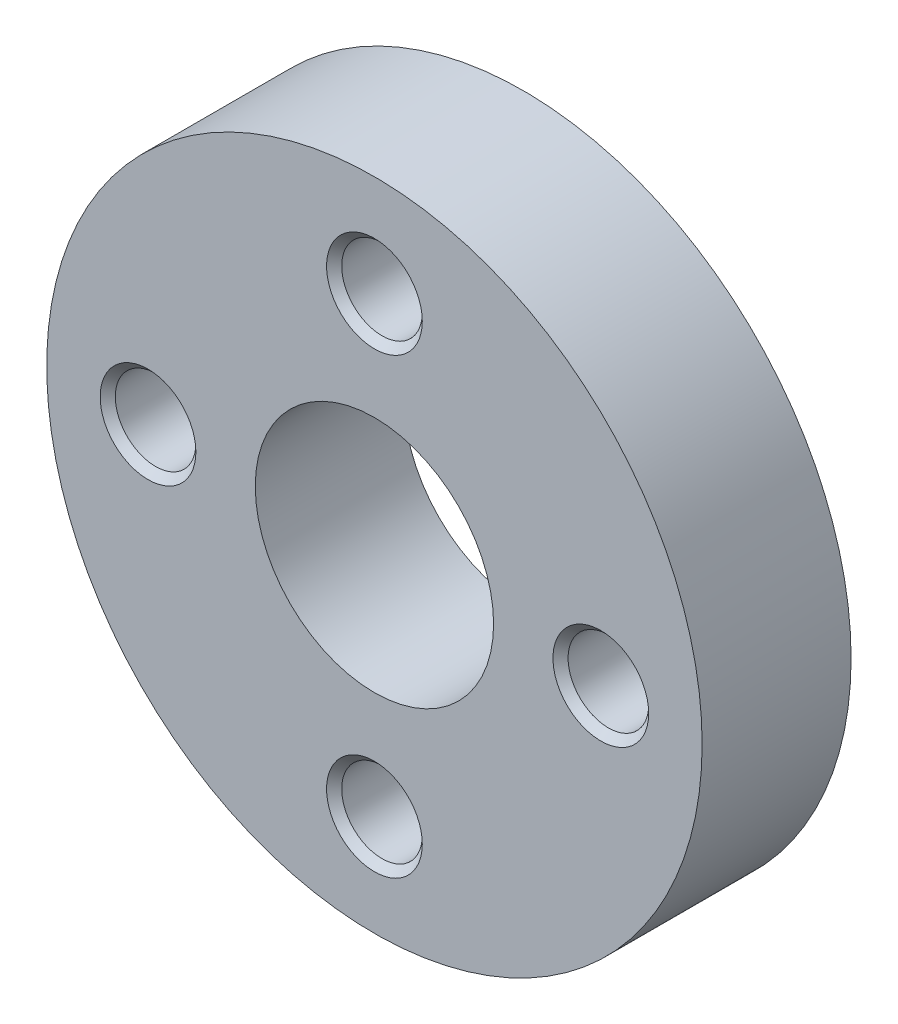
ISO-10303-21;
HEADER;
FILE_DESCRIPTION(('STEP AP214'),'2;1');
FILE_NAME('part.step','',(''),(''),'','','');
FILE_SCHEMA(('AUTOMOTIVE_DESIGN { 1 0 10303 214 1 1 1 1 }'));
ENDSEC;
DATA;
#1=APPLICATION_CONTEXT('core data for automotive mechanical design processes');
#2=APPLICATION_PROTOCOL_DEFINITION('international standard','automotive_design',2000,#1);
#3=PRODUCT_CONTEXT('',#1,'mechanical');
#4=PRODUCT('Part','Part','',(#3));
#5=PRODUCT_RELATED_PRODUCT_CATEGORY('part','',(#4));
#6=PRODUCT_DEFINITION_FORMATION('','',#4);
#7=PRODUCT_DEFINITION_CONTEXT('part definition',#1,'design');
#8=PRODUCT_DEFINITION('design','',#6,#7);
#9=PRODUCT_DEFINITION_SHAPE('','',#8);
#10=(LENGTH_UNIT() NAMED_UNIT(*) SI_UNIT(.MILLI.,.METRE.));
#11=(NAMED_UNIT(*) PLANE_ANGLE_UNIT() SI_UNIT($,.RADIAN.));
#12=(NAMED_UNIT(*) SI_UNIT($,.STERADIAN.) SOLID_ANGLE_UNIT());
#13=UNCERTAINTY_MEASURE_WITH_UNIT(LENGTH_MEASURE(1.E-05),#10,'distance_accuracy_value','');
#14=(GEOMETRIC_REPRESENTATION_CONTEXT(3) GLOBAL_UNCERTAINTY_ASSIGNED_CONTEXT((#13)) GLOBAL_UNIT_ASSIGNED_CONTEXT((#10,
#11,#12)) REPRESENTATION_CONTEXT('',''));
#15=CARTESIAN_POINT('',(0.,0.,0.));
#16=DIRECTION('',(0.,0.,1.));
#17=DIRECTION('',(1.,0.,0.));
#18=AXIS2_PLACEMENT_3D('',#15,#16,#17);
#19=CARTESIAN_POINT('',(0.,0.,-2.5));
#20=DIRECTION('',(0.,0.,1.));
#21=DIRECTION('',(1.,0.,0.));
#22=AXIS2_PLACEMENT_3D('',#19,#20,#21);
#23=CYLINDRICAL_SURFACE('',#22,11.);
#24=CARTESIAN_POINT('',(0.,0.,-2.5));
#25=DIRECTION('',(0.,0.,1.));
#26=DIRECTION('',(1.,0.,0.));
#27=AXIS2_PLACEMENT_3D('',#24,#25,#26);
#28=CIRCLE('',#27,11.);
#29=CARTESIAN_POINT('',(11.,0.,-2.5));
#30=VERTEX_POINT('',#29);
#31=EDGE_CURVE('E85',#30,#30,#28,.T.);
#32=ORIENTED_EDGE('',*,*,#31,.T.);
#33=EDGE_LOOP('',(#32));
#34=FACE_BOUND('',#33,.T.);
#35=CARTESIAN_POINT('',(0.,0.,2.5));
#36=DIRECTION('',(0.,0.,1.));
#37=DIRECTION('',(1.,0.,0.));
#38=AXIS2_PLACEMENT_3D('',#35,#36,#37);
#39=CIRCLE('',#38,11.);
#40=CARTESIAN_POINT('',(11.,0.,2.5));
#41=VERTEX_POINT('',#40);
#42=EDGE_CURVE('E86',#41,#41,#39,.T.);
#43=ORIENTED_EDGE('',*,*,#42,.F.);
#44=EDGE_LOOP('',(#43));
#45=FACE_BOUND('',#44,.T.);
#46=ADVANCED_FACE('F29',(#34,#45),#23,.T.);
#47=CARTESIAN_POINT('',(0.,0.,-2.5));
#48=DIRECTION('',(0.,0.,1.));
#49=DIRECTION('',(1.,0.,0.));
#50=AXIS2_PLACEMENT_3D('',#47,#48,#49);
#51=PLANE('',#50);
#52=CARTESIAN_POINT('',(0.,0.,-2.5));
#53=DIRECTION('',(0.,0.,1.));
#54=DIRECTION('',(1.,0.,0.));
#55=AXIS2_PLACEMENT_3D('',#52,#53,#54);
#56=CIRCLE('',#55,4.);
#57=CARTESIAN_POINT('',(4.,0.,-2.5));
#58=VERTEX_POINT('',#57);
#59=EDGE_CURVE('E89',#58,#58,#56,.T.);
#60=ORIENTED_EDGE('',*,*,#59,.T.);
#61=EDGE_LOOP('',(#60));
#62=FACE_BOUND('',#61,.T.);
#63=CARTESIAN_POINT('',(0.,-7.59934207678533,-2.5));
#64=DIRECTION('',(0.,0.,1.));
#65=DIRECTION('',(1.,0.,0.));
#66=AXIS2_PLACEMENT_3D('',#63,#64,#65);
#67=CIRCLE('',#66,1.60654999999999);
#68=CARTESIAN_POINT('',(1.60654999999999,-7.59934207678533,-2.5));
#69=VERTEX_POINT('',#68);
#70=EDGE_CURVE('E73',#69,#69,#67,.T.);
#71=ORIENTED_EDGE('',*,*,#70,.T.);
#72=EDGE_LOOP('',(#71));
#73=FACE_BOUND('',#72,.T.);
#74=CARTESIAN_POINT('',(-7.59934207678533,0.,-2.5));
#75=DIRECTION('',(0.,0.,1.));
#76=DIRECTION('',(1.,0.,0.));
#77=AXIS2_PLACEMENT_3D('',#74,#75,#76);
#78=CIRCLE('',#77,1.60655);
#79=CARTESIAN_POINT('',(-5.99279207678533,0.,-2.5));
#80=VERTEX_POINT('',#79);
#81=EDGE_CURVE('E76',#80,#80,#78,.T.);
#82=ORIENTED_EDGE('',*,*,#81,.T.);
#83=EDGE_LOOP('',(#82));
#84=FACE_BOUND('',#83,.T.);
#85=CARTESIAN_POINT('',(0.,7.59934207678533,-2.5));
#86=DIRECTION('',(0.,0.,1.));
#87=DIRECTION('',(1.,0.,0.));
#88=AXIS2_PLACEMENT_3D('',#85,#86,#87);
#89=CIRCLE('',#88,1.60654999999999);
#90=CARTESIAN_POINT('',(1.60654999999999,7.59934207678533,-2.5));
#91=VERTEX_POINT('',#90);
#92=EDGE_CURVE('E79',#91,#91,#89,.T.);
#93=ORIENTED_EDGE('',*,*,#92,.T.);
#94=EDGE_LOOP('',(#93));
#95=FACE_BOUND('',#94,.T.);
#96=CARTESIAN_POINT('',(7.59934207678533,0.,-2.5));
#97=DIRECTION('',(0.,0.,1.));
#98=DIRECTION('',(1.,0.,0.));
#99=AXIS2_PLACEMENT_3D('',#96,#97,#98);
#100=CIRCLE('',#99,1.60654999999999);
#101=CARTESIAN_POINT('',(9.20589207678533,0.,-2.5));
#102=VERTEX_POINT('',#101);
#103=EDGE_CURVE('E82',#102,#102,#100,.T.);
#104=ORIENTED_EDGE('',*,*,#103,.T.);
#105=EDGE_LOOP('',(#104));
#106=FACE_BOUND('',#105,.T.);
#107=ORIENTED_EDGE('',*,*,#31,.F.);
#108=EDGE_LOOP('',(#107));
#109=FACE_BOUND('',#108,.T.);
#110=ADVANCED_FACE('F98',(#62,#73,#84,#95,#106,#109),#51,.F.);
#111=CARTESIAN_POINT('',(0.,0.,2.5));
#112=DIRECTION('',(0.,0.,1.));
#113=DIRECTION('',(1.,0.,0.));
#114=AXIS2_PLACEMENT_3D('',#111,#112,#113);
#115=PLANE('',#114);
#116=CARTESIAN_POINT('',(0.,0.,2.5));
#117=DIRECTION('',(0.,0.,1.));
#118=DIRECTION('',(1.,0.,0.));
#119=AXIS2_PLACEMENT_3D('',#116,#117,#118);
#120=CIRCLE('',#119,4.);
#121=CARTESIAN_POINT('',(4.,0.,2.5));
#122=VERTEX_POINT('',#121);
#123=EDGE_CURVE('E92',#122,#122,#120,.T.);
#124=ORIENTED_EDGE('',*,*,#123,.F.);
#125=EDGE_LOOP('',(#124));
#126=FACE_BOUND('',#125,.T.);
#127=CARTESIAN_POINT('',(7.59934207678533,0.,2.5));
#128=DIRECTION('',(0.,0.,1.));
#129=DIRECTION('',(1.,0.,0.));
#130=AXIS2_PLACEMENT_3D('',#127,#128,#129);
#131=CIRCLE('',#130,1.60654999999999);
#132=CARTESIAN_POINT('',(9.20589207678532,0.,2.5));
#133=VERTEX_POINT('',#132);
#134=EDGE_CURVE('E10',#133,#133,#131,.F.);
#135=ORIENTED_EDGE('',*,*,#134,.T.);
#136=EDGE_LOOP('',(#135));
#137=FACE_BOUND('',#136,.T.);
#138=CARTESIAN_POINT('',(0.,-7.59934207678533,2.5));
#139=DIRECTION('',(0.,0.,1.));
#140=DIRECTION('',(1.,0.,0.));
#141=AXIS2_PLACEMENT_3D('',#138,#139,#140);
#142=CIRCLE('',#141,1.60654999999999);
#143=CARTESIAN_POINT('',(1.60654999999999,-7.59934207678533,2.5));
#144=VERTEX_POINT('',#143);
#145=EDGE_CURVE('E36',#144,#144,#142,.F.);
#146=ORIENTED_EDGE('',*,*,#145,.T.);
#147=EDGE_LOOP('',(#146));
#148=FACE_BOUND('',#147,.T.);
#149=CARTESIAN_POINT('',(-7.59934207678533,0.,2.5));
#150=DIRECTION('',(0.,0.,1.));
#151=DIRECTION('',(1.,0.,0.));
#152=AXIS2_PLACEMENT_3D('',#149,#150,#151);
#153=CIRCLE('',#152,1.60654999999999);
#154=CARTESIAN_POINT('',(-5.99279207678534,0.,2.5));
#155=VERTEX_POINT('',#154);
#156=EDGE_CURVE('E40',#155,#155,#153,.F.);
#157=ORIENTED_EDGE('',*,*,#156,.T.);
#158=EDGE_LOOP('',(#157));
#159=FACE_BOUND('',#158,.T.);
#160=CARTESIAN_POINT('',(0.,7.59934207678533,2.5));
#161=DIRECTION('',(0.,0.,1.));
#162=DIRECTION('',(1.,0.,0.));
#163=AXIS2_PLACEMENT_3D('',#160,#161,#162);
#164=CIRCLE('',#163,1.60654999999999);
#165=CARTESIAN_POINT('',(1.60654999999999,7.59934207678533,2.5));
#166=VERTEX_POINT('',#165);
#167=EDGE_CURVE('E44',#166,#166,#164,.F.);
#168=ORIENTED_EDGE('',*,*,#167,.T.);
#169=EDGE_LOOP('',(#168));
#170=FACE_BOUND('',#169,.T.);
#171=ORIENTED_EDGE('',*,*,#42,.T.);
#172=EDGE_LOOP('',(#171));
#173=FACE_BOUND('',#172,.T.);
#174=ADVANCED_FACE('F107',(#126,#137,#148,#159,#170,#173),#115,.T.);
#175=CARTESIAN_POINT('',(0.,-7.59934207678533,2.5));
#176=DIRECTION('',(0.,0.,1.));
#177=DIRECTION('',(1.,0.,0.));
#178=AXIS2_PLACEMENT_3D('',#175,#176,#177);
#179=CYLINDRICAL_SURFACE('',#178,1.35254999999999);
#180=CARTESIAN_POINT('',(0.,-7.59934207678533,-2.246));
#181=DIRECTION('',(0.,0.,1.));
#182=DIRECTION('',(1.,0.,0.));
#183=AXIS2_PLACEMENT_3D('',#180,#181,#182);
#184=CIRCLE('',#183,1.35254999999999);
#185=CARTESIAN_POINT('',(1.35254999999999,-7.59934207678533,-2.246));
#186=VERTEX_POINT('',#185);
#187=EDGE_CURVE('E67',#186,#186,#184,.F.);
#188=ORIENTED_EDGE('',*,*,#187,.T.);
#189=EDGE_LOOP('',(#188));
#190=FACE_BOUND('',#189,.T.);
#191=CARTESIAN_POINT('',(0.,-7.59934207678533,2.246));
#192=DIRECTION('',(0.,0.,1.));
#193=DIRECTION('',(1.,0.,0.));
#194=AXIS2_PLACEMENT_3D('',#191,#192,#193);
#195=CIRCLE('',#194,1.35254999999999);
#196=CARTESIAN_POINT('',(1.35254999999999,-7.59934207678533,2.246));
#197=VERTEX_POINT('',#196);
#198=EDGE_CURVE('E70',#197,#197,#195,.T.);
#199=ORIENTED_EDGE('',*,*,#198,.T.);
#200=EDGE_LOOP('',(#199));
#201=FACE_BOUND('',#200,.T.);
#202=ADVANCED_FACE('F109',(#190,#201),#179,.F.);
#203=CARTESIAN_POINT('',(7.59934207678533,0.,2.5));
#204=DIRECTION('',(0.,0.,1.));
#205=DIRECTION('',(1.,0.,0.));
#206=AXIS2_PLACEMENT_3D('',#203,#204,#205);
#207=CYLINDRICAL_SURFACE('',#206,1.35254999999999);
#208=CARTESIAN_POINT('',(7.59934207678533,0.,-2.246));
#209=DIRECTION('',(0.,0.,1.));
#210=DIRECTION('',(1.,0.,0.));
#211=AXIS2_PLACEMENT_3D('',#208,#209,#210);
#212=CIRCLE('',#211,1.35254999999999);
#213=CARTESIAN_POINT('',(8.95189207678532,0.,-2.246));
#214=VERTEX_POINT('',#213);
#215=EDGE_CURVE('E49',#214,#214,#212,.F.);
#216=ORIENTED_EDGE('',*,*,#215,.T.);
#217=EDGE_LOOP('',(#216));
#218=FACE_BOUND('',#217,.T.);
#219=CARTESIAN_POINT('',(7.59934207678533,0.,2.246));
#220=DIRECTION('',(0.,0.,1.));
#221=DIRECTION('',(1.,0.,0.));
#222=AXIS2_PLACEMENT_3D('',#219,#220,#221);
#223=CIRCLE('',#222,1.35254999999999);
#224=CARTESIAN_POINT('',(8.95189207678532,0.,2.246));
#225=VERTEX_POINT('',#224);
#226=EDGE_CURVE('E52',#225,#225,#223,.T.);
#227=ORIENTED_EDGE('',*,*,#226,.T.);
#228=EDGE_LOOP('',(#227));
#229=FACE_BOUND('',#228,.T.);
#230=ADVANCED_FACE('F162',(#218,#229),#207,.F.);
#231=CARTESIAN_POINT('',(-7.59934207678533,0.,2.5));
#232=DIRECTION('',(0.,0.,1.));
#233=DIRECTION('',(1.,0.,0.));
#234=AXIS2_PLACEMENT_3D('',#231,#232,#233);
#235=CYLINDRICAL_SURFACE('',#234,1.35254999999999);
#236=CARTESIAN_POINT('',(-7.59934207678533,0.,-2.24599999999999));
#237=DIRECTION('',(0.,0.,1.));
#238=DIRECTION('',(1.,0.,0.));
#239=AXIS2_PLACEMENT_3D('',#236,#237,#238);
#240=CIRCLE('',#239,1.35254999999999);
#241=CARTESIAN_POINT('',(-6.24679207678534,0.,-2.24599999999999));
#242=VERTEX_POINT('',#241);
#243=EDGE_CURVE('E61',#242,#242,#240,.F.);
#244=ORIENTED_EDGE('',*,*,#243,.T.);
#245=EDGE_LOOP('',(#244));
#246=FACE_BOUND('',#245,.T.);
#247=CARTESIAN_POINT('',(-7.59934207678533,0.,2.246));
#248=DIRECTION('',(0.,0.,1.));
#249=DIRECTION('',(1.,0.,0.));
#250=AXIS2_PLACEMENT_3D('',#247,#248,#249);
#251=CIRCLE('',#250,1.35254999999999);
#252=CARTESIAN_POINT('',(-6.24679207678534,0.,2.246));
#253=VERTEX_POINT('',#252);
#254=EDGE_CURVE('E64',#253,#253,#251,.T.);
#255=ORIENTED_EDGE('',*,*,#254,.T.);
#256=EDGE_LOOP('',(#255));
#257=FACE_BOUND('',#256,.T.);
#258=ADVANCED_FACE('F160',(#246,#257),#235,.F.);
#259=CARTESIAN_POINT('',(0.,7.59934207678533,2.5));
#260=DIRECTION('',(0.,0.,1.));
#261=DIRECTION('',(1.,0.,0.));
#262=AXIS2_PLACEMENT_3D('',#259,#260,#261);
#263=CYLINDRICAL_SURFACE('',#262,1.35254999999999);
#264=CARTESIAN_POINT('',(0.,7.59934207678533,-2.246));
#265=DIRECTION('',(0.,0.,1.));
#266=DIRECTION('',(1.,0.,0.));
#267=AXIS2_PLACEMENT_3D('',#264,#265,#266);
#268=CIRCLE('',#267,1.35254999999999);
#269=CARTESIAN_POINT('',(1.35254999999999,7.59934207678533,-2.246));
#270=VERTEX_POINT('',#269);
#271=EDGE_CURVE('E55',#270,#270,#268,.F.);
#272=ORIENTED_EDGE('',*,*,#271,.T.);
#273=EDGE_LOOP('',(#272));
#274=FACE_BOUND('',#273,.T.);
#275=CARTESIAN_POINT('',(0.,7.59934207678533,2.246));
#276=DIRECTION('',(0.,0.,1.));
#277=DIRECTION('',(1.,0.,0.));
#278=AXIS2_PLACEMENT_3D('',#275,#276,#277);
#279=CIRCLE('',#278,1.35254999999999);
#280=CARTESIAN_POINT('',(1.35254999999999,7.59934207678533,2.246));
#281=VERTEX_POINT('',#280);
#282=EDGE_CURVE('E58',#281,#281,#279,.T.);
#283=ORIENTED_EDGE('',*,*,#282,.T.);
#284=EDGE_LOOP('',(#283));
#285=FACE_BOUND('',#284,.T.);
#286=ADVANCED_FACE('F130',(#274,#285),#263,.F.);
#287=CARTESIAN_POINT('',(0.,-7.59934207678533,-2.5));
#288=DIRECTION('',(0.,0.,-1.));
#289=DIRECTION('',(-1.,0.,0.));
#290=AXIS2_PLACEMENT_3D('',#287,#288,#289);
#291=CONICAL_SURFACE('',#290,1.60654999999999,0.785398163397451);
#292=ORIENTED_EDGE('',*,*,#187,.F.);
#293=EDGE_LOOP('',(#292));
#294=FACE_BOUND('',#293,.T.);
#295=ORIENTED_EDGE('',*,*,#70,.F.);
#296=EDGE_LOOP('',(#295));
#297=FACE_BOUND('',#296,.T.);
#298=ADVANCED_FACE('F126',(#294,#297),#291,.F.);
#299=CARTESIAN_POINT('',(-7.59934207678533,0.,-2.5));
#300=DIRECTION('',(0.,0.,-1.));
#301=DIRECTION('',(-1.,0.,0.));
#302=AXIS2_PLACEMENT_3D('',#299,#300,#301);
#303=CONICAL_SURFACE('',#302,1.60655,0.785398163397441);
#304=ORIENTED_EDGE('',*,*,#243,.F.);
#305=EDGE_LOOP('',(#304));
#306=FACE_BOUND('',#305,.T.);
#307=ORIENTED_EDGE('',*,*,#81,.F.);
#308=EDGE_LOOP('',(#307));
#309=FACE_BOUND('',#308,.T.);
#310=ADVANCED_FACE('F129',(#306,#309),#303,.F.);
#311=CARTESIAN_POINT('',(0.,7.59934207678533,-2.5));
#312=DIRECTION('',(0.,0.,-1.));
#313=DIRECTION('',(-1.,0.,0.));
#314=AXIS2_PLACEMENT_3D('',#311,#312,#313);
#315=CONICAL_SURFACE('',#314,1.60654999999999,0.785398163397451);
#316=ORIENTED_EDGE('',*,*,#271,.F.);
#317=EDGE_LOOP('',(#316));
#318=FACE_BOUND('',#317,.T.);
#319=ORIENTED_EDGE('',*,*,#92,.F.);
#320=EDGE_LOOP('',(#319));
#321=FACE_BOUND('',#320,.T.);
#322=ADVANCED_FACE('F134',(#318,#321),#315,.F.);
#323=CARTESIAN_POINT('',(7.59934207678533,0.,-2.5));
#324=DIRECTION('',(0.,0.,-1.));
#325=DIRECTION('',(-1.,0.,0.));
#326=AXIS2_PLACEMENT_3D('',#323,#324,#325);
#327=CONICAL_SURFACE('',#326,1.60654999999999,0.78539816339745);
#328=ORIENTED_EDGE('',*,*,#215,.F.);
#329=EDGE_LOOP('',(#328));
#330=FACE_BOUND('',#329,.T.);
#331=ORIENTED_EDGE('',*,*,#103,.F.);
#332=EDGE_LOOP('',(#331));
#333=FACE_BOUND('',#332,.T.);
#334=ADVANCED_FACE('F138',(#330,#333),#327,.F.);
#335=CARTESIAN_POINT('',(7.59934207678533,0.,2.246));
#336=DIRECTION('',(0.,0.,1.));
#337=DIRECTION('',(1.,0.,0.));
#338=AXIS2_PLACEMENT_3D('',#335,#336,#337);
#339=CONICAL_SURFACE('',#338,1.35254999999999,0.785398163397453);
#340=ORIENTED_EDGE('',*,*,#134,.F.);
#341=EDGE_LOOP('',(#340));
#342=FACE_BOUND('',#341,.T.);
#343=ORIENTED_EDGE('',*,*,#226,.F.);
#344=EDGE_LOOP('',(#343));
#345=FACE_BOUND('',#344,.T.);
#346=ADVANCED_FACE('F142',(#342,#345),#339,.F.);
#347=CARTESIAN_POINT('',(0.,-7.59934207678533,2.246));
#348=DIRECTION('',(0.,0.,1.));
#349=DIRECTION('',(1.,0.,0.));
#350=AXIS2_PLACEMENT_3D('',#347,#348,#349);
#351=CONICAL_SURFACE('',#350,1.35254999999999,0.785398163397452);
#352=ORIENTED_EDGE('',*,*,#145,.F.);
#353=EDGE_LOOP('',(#352));
#354=FACE_BOUND('',#353,.T.);
#355=ORIENTED_EDGE('',*,*,#198,.F.);
#356=EDGE_LOOP('',(#355));
#357=FACE_BOUND('',#356,.T.);
#358=ADVANCED_FACE('F146',(#354,#357),#351,.F.);
#359=CARTESIAN_POINT('',(-7.59934207678533,0.,2.246));
#360=DIRECTION('',(0.,0.,1.));
#361=DIRECTION('',(1.,0.,0.));
#362=AXIS2_PLACEMENT_3D('',#359,#360,#361);
#363=CONICAL_SURFACE('',#362,1.35254999999999,0.785398163397452);
#364=ORIENTED_EDGE('',*,*,#156,.F.);
#365=EDGE_LOOP('',(#364));
#366=FACE_BOUND('',#365,.T.);
#367=ORIENTED_EDGE('',*,*,#254,.F.);
#368=EDGE_LOOP('',(#367));
#369=FACE_BOUND('',#368,.T.);
#370=ADVANCED_FACE('F149',(#366,#369),#363,.F.);
#371=CARTESIAN_POINT('',(0.,7.59934207678533,2.246));
#372=DIRECTION('',(0.,0.,1.));
#373=DIRECTION('',(1.,0.,0.));
#374=AXIS2_PLACEMENT_3D('',#371,#372,#373);
#375=CONICAL_SURFACE('',#374,1.35254999999999,0.785398163397452);
#376=ORIENTED_EDGE('',*,*,#167,.F.);
#377=EDGE_LOOP('',(#376));
#378=FACE_BOUND('',#377,.T.);
#379=ORIENTED_EDGE('',*,*,#282,.F.);
#380=EDGE_LOOP('',(#379));
#381=FACE_BOUND('',#380,.T.);
#382=ADVANCED_FACE('F31',(#378,#381),#375,.F.);
#383=CARTESIAN_POINT('',(0.,0.,-2.5));
#384=DIRECTION('',(0.,0.,1.));
#385=DIRECTION('',(1.,0.,0.));
#386=AXIS2_PLACEMENT_3D('',#383,#384,#385);
#387=CYLINDRICAL_SURFACE('',#386,4.);
#388=ORIENTED_EDGE('',*,*,#59,.F.);
#389=EDGE_LOOP('',(#388));
#390=FACE_BOUND('',#389,.T.);
#391=ORIENTED_EDGE('',*,*,#123,.T.);
#392=EDGE_LOOP('',(#391));
#393=FACE_BOUND('',#392,.T.);
#394=ADVANCED_FACE('F101',(#390,#393),#387,.F.);
#395=CLOSED_SHELL('',(#46,#110,#174,#202,#230,#258,#286,#298,#310,#322,#334,#346,#358,#370,#382,#394));
#396=MANIFOLD_SOLID_BREP('B2',#395);
#397=ADVANCED_BREP_SHAPE_REPRESENTATION('',(#18,#396),#14);
#398=SHAPE_DEFINITION_REPRESENTATION(#9,#397);
ENDSEC;
END-ISO-10303-21;
